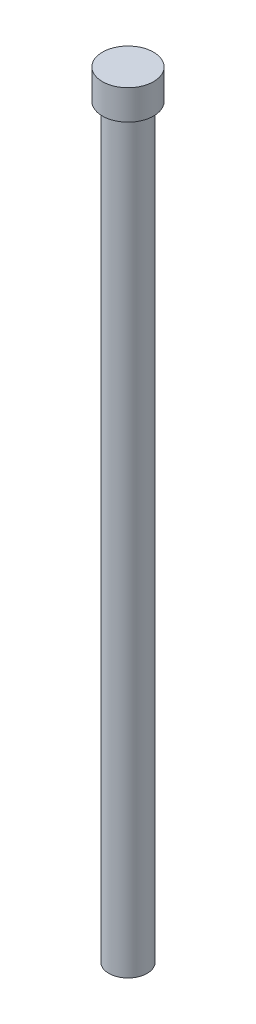
ISO-10303-21;
HEADER;
FILE_DESCRIPTION(('STEP AP214'),'2;1');
FILE_NAME('part.step','',(''),(''),'','','');
FILE_SCHEMA(('AUTOMOTIVE_DESIGN { 1 0 10303 214 1 1 1 1 }'));
ENDSEC;
DATA;
#1=APPLICATION_CONTEXT('core data for automotive mechanical design processes');
#2=APPLICATION_PROTOCOL_DEFINITION('international standard','automotive_design',2000,#1);
#3=PRODUCT_CONTEXT('',#1,'mechanical');
#4=PRODUCT('Part','Part','',(#3));
#5=PRODUCT_RELATED_PRODUCT_CATEGORY('part','',(#4));
#6=PRODUCT_DEFINITION_FORMATION('','',#4);
#7=PRODUCT_DEFINITION_CONTEXT('part definition',#1,'design');
#8=PRODUCT_DEFINITION('design','',#6,#7);
#9=PRODUCT_DEFINITION_SHAPE('','',#8);
#10=(LENGTH_UNIT() NAMED_UNIT(*) SI_UNIT(.MILLI.,.METRE.));
#11=(NAMED_UNIT(*) PLANE_ANGLE_UNIT() SI_UNIT($,.RADIAN.));
#12=(NAMED_UNIT(*) SI_UNIT($,.STERADIAN.) SOLID_ANGLE_UNIT());
#13=UNCERTAINTY_MEASURE_WITH_UNIT(LENGTH_MEASURE(1.E-05),#10,'distance_accuracy_value','');
#14=(GEOMETRIC_REPRESENTATION_CONTEXT(3) GLOBAL_UNCERTAINTY_ASSIGNED_CONTEXT((#13)) GLOBAL_UNIT_ASSIGNED_CONTEXT((#10,
#11,#12)) REPRESENTATION_CONTEXT('',''));
#15=CARTESIAN_POINT('',(0.,0.,0.));
#16=DIRECTION('',(0.,0.,1.));
#17=DIRECTION('',(1.,0.,0.));
#18=AXIS2_PLACEMENT_3D('',#15,#16,#17);
#19=CARTESIAN_POINT('',(0.,35.,0.));
#20=DIRECTION('',(0.,-1.,0.));
#21=DIRECTION('',(0.,0.,-1.));
#22=AXIS2_PLACEMENT_3D('',#19,#20,#21);
#23=CYLINDRICAL_SURFACE('',#22,0.9);
#24=CARTESIAN_POINT('',(0.,35.,0.));
#25=DIRECTION('',(0.,1.,0.));
#26=DIRECTION('',(0.,0.,1.));
#27=AXIS2_PLACEMENT_3D('',#24,#25,#26);
#28=CIRCLE('',#27,0.9);
#29=CARTESIAN_POINT('',(0.,35.,0.9));
#30=VERTEX_POINT('',#29);
#31=EDGE_CURVE('E10',#30,#30,#28,.T.);
#32=ORIENTED_EDGE('',*,*,#31,.F.);
#33=EDGE_LOOP('',(#32));
#34=FACE_BOUND('',#33,.T.);
#35=CARTESIAN_POINT('',(0.,0.,0.));
#36=DIRECTION('',(0.,1.,0.));
#37=DIRECTION('',(0.,0.,1.));
#38=AXIS2_PLACEMENT_3D('',#35,#36,#37);
#39=CIRCLE('',#38,0.9);
#40=CARTESIAN_POINT('',(0.,0.,0.9));
#41=VERTEX_POINT('',#40);
#42=EDGE_CURVE('E43',#41,#41,#39,.T.);
#43=ORIENTED_EDGE('',*,*,#42,.T.);
#44=EDGE_LOOP('',(#43));
#45=FACE_BOUND('',#44,.T.);
#46=ADVANCED_FACE('F40',(#34,#45),#23,.T.);
#47=CARTESIAN_POINT('',(0.,0.,0.));
#48=DIRECTION('',(0.,1.,0.));
#49=DIRECTION('',(0.,0.,1.));
#50=AXIS2_PLACEMENT_3D('',#47,#48,#49);
#51=PLANE('',#50);
#52=ORIENTED_EDGE('',*,*,#42,.F.);
#53=EDGE_LOOP('',(#52));
#54=FACE_BOUND('',#53,.T.);
#55=ADVANCED_FACE('F67',(#54),#51,.F.);
#56=CARTESIAN_POINT('',(0.,36.4,0.));
#57=DIRECTION('',(0.,-1.,0.));
#58=DIRECTION('',(0.,0.,-1.));
#59=AXIS2_PLACEMENT_3D('',#56,#57,#58);
#60=CYLINDRICAL_SURFACE('',#59,1.2);
#61=CARTESIAN_POINT('',(0.,36.4,0.));
#62=DIRECTION('',(0.,1.,0.));
#63=DIRECTION('',(0.,0.,1.));
#64=AXIS2_PLACEMENT_3D('',#61,#62,#63);
#65=CIRCLE('',#64,1.2);
#66=CARTESIAN_POINT('',(0.,36.4,1.2));
#67=VERTEX_POINT('',#66);
#68=EDGE_CURVE('E52',#67,#67,#65,.T.);
#69=ORIENTED_EDGE('',*,*,#68,.F.);
#70=EDGE_LOOP('',(#69));
#71=FACE_BOUND('',#70,.T.);
#72=CARTESIAN_POINT('',(0.,35.,0.));
#73=DIRECTION('',(0.,1.,0.));
#74=DIRECTION('',(0.,0.,1.));
#75=AXIS2_PLACEMENT_3D('',#72,#73,#74);
#76=CIRCLE('',#75,1.2);
#77=CARTESIAN_POINT('',(0.,35.,1.2));
#78=VERTEX_POINT('',#77);
#79=EDGE_CURVE('E54',#78,#78,#76,.T.);
#80=ORIENTED_EDGE('',*,*,#79,.T.);
#81=EDGE_LOOP('',(#80));
#82=FACE_BOUND('',#81,.T.);
#83=ADVANCED_FACE('F64',(#71,#82),#60,.T.);
#84=CARTESIAN_POINT('',(0.,36.4,0.));
#85=DIRECTION('',(0.,1.,0.));
#86=DIRECTION('',(0.,0.,1.));
#87=AXIS2_PLACEMENT_3D('',#84,#85,#86);
#88=PLANE('',#87);
#89=ORIENTED_EDGE('',*,*,#68,.T.);
#90=EDGE_LOOP('',(#89));
#91=FACE_BOUND('',#90,.T.);
#92=ADVANCED_FACE('F62',(#91),#88,.T.);
#93=CARTESIAN_POINT('',(0.,35.,0.));
#94=DIRECTION('',(0.,1.,0.));
#95=DIRECTION('',(0.,0.,1.));
#96=AXIS2_PLACEMENT_3D('',#93,#94,#95);
#97=PLANE('',#96);
#98=ORIENTED_EDGE('',*,*,#31,.T.);
#99=EDGE_LOOP('',(#98));
#100=FACE_BOUND('',#99,.T.);
#101=ORIENTED_EDGE('',*,*,#79,.F.);
#102=EDGE_LOOP('',(#101));
#103=FACE_BOUND('',#102,.T.);
#104=ADVANCED_FACE('F71',(#100,#103),#97,.F.);
#105=CLOSED_SHELL('',(#46,#55,#83,#92,#104));
#106=MANIFOLD_SOLID_BREP('B2',#105);
#107=ADVANCED_BREP_SHAPE_REPRESENTATION('',(#18,#106),#14);
#108=SHAPE_DEFINITION_REPRESENTATION(#9,#107);
ENDSEC;
END-ISO-10303-21;
